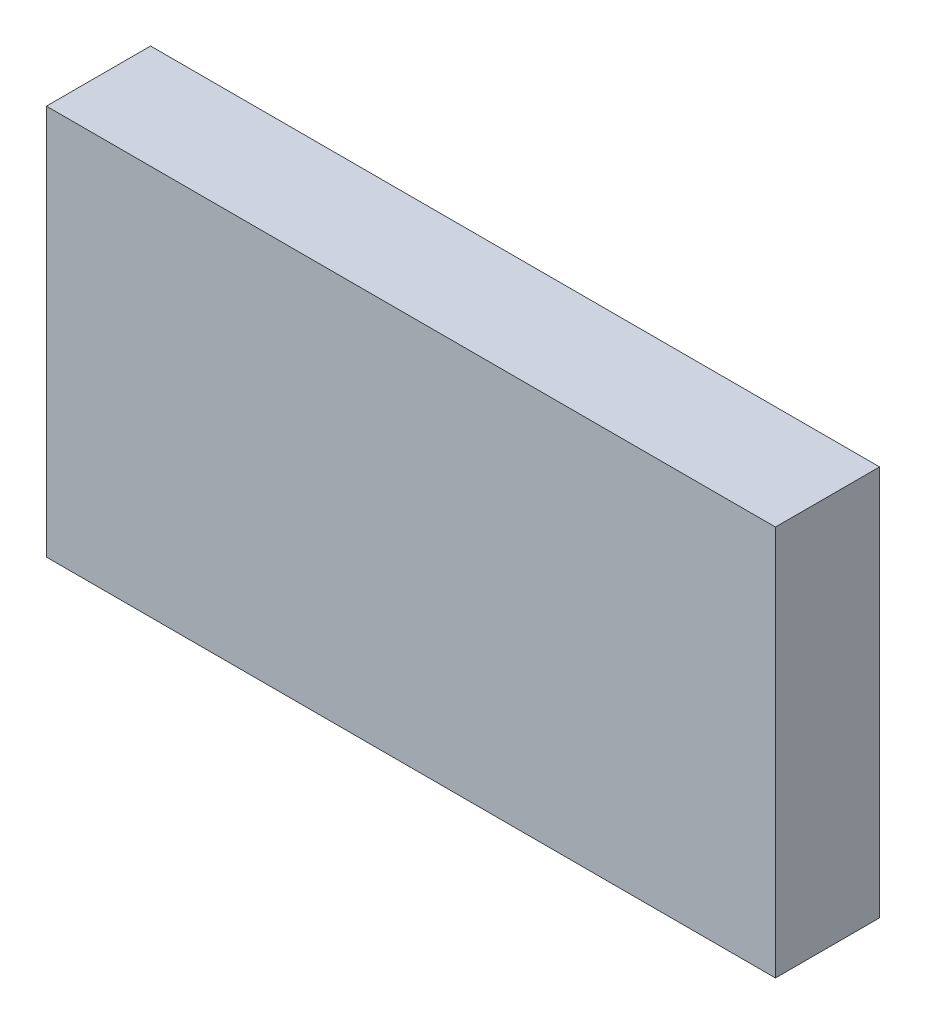
ISO-10303-21;
HEADER;
FILE_DESCRIPTION(('STEP AP214'),'2;1');
FILE_NAME('part.step','',(''),(''),'','','');
FILE_SCHEMA(('AUTOMOTIVE_DESIGN { 1 0 10303 214 1 1 1 1 }'));
ENDSEC;
DATA;
#1=APPLICATION_CONTEXT('core data for automotive mechanical design processes');
#2=APPLICATION_PROTOCOL_DEFINITION('international standard','automotive_design',2000,#1);
#3=PRODUCT_CONTEXT('',#1,'mechanical');
#4=PRODUCT('Part','Part','',(#3));
#5=PRODUCT_RELATED_PRODUCT_CATEGORY('part','',(#4));
#6=PRODUCT_DEFINITION_FORMATION('','',#4);
#7=PRODUCT_DEFINITION_CONTEXT('part definition',#1,'design');
#8=PRODUCT_DEFINITION('design','',#6,#7);
#9=PRODUCT_DEFINITION_SHAPE('','',#8);
#10=(LENGTH_UNIT() NAMED_UNIT(*) SI_UNIT(.MILLI.,.METRE.));
#11=(NAMED_UNIT(*) PLANE_ANGLE_UNIT() SI_UNIT($,.RADIAN.));
#12=(NAMED_UNIT(*) SI_UNIT($,.STERADIAN.) SOLID_ANGLE_UNIT());
#13=UNCERTAINTY_MEASURE_WITH_UNIT(LENGTH_MEASURE(1.E-05),#10,'distance_accuracy_value','');
#14=(GEOMETRIC_REPRESENTATION_CONTEXT(3) GLOBAL_UNCERTAINTY_ASSIGNED_CONTEXT((#13)) GLOBAL_UNIT_ASSIGNED_CONTEXT((#10,
#11,#12)) REPRESENTATION_CONTEXT('',''));
#15=CARTESIAN_POINT('',(0.,0.,0.));
#16=DIRECTION('',(0.,0.,1.));
#17=DIRECTION('',(1.,0.,0.));
#18=AXIS2_PLACEMENT_3D('',#15,#16,#17);
#19=CARTESIAN_POINT('',(0.104909158135323,-0.637922808555993,0.0826433070866142));
#20=DIRECTION('',(0.,0.,-1.));
#21=DIRECTION('',(0.,1.,0.));
#22=AXIS2_PLACEMENT_3D('',#19,#20,#21);
#23=PLANE('',#22);
#24=DIRECTION('',(0.,1.,0.));
#25=VECTOR('',#24,1.);
#26=CARTESIAN_POINT('',(0.108436717190441,-0.637922808555993,0.0826433070866142));
#27=LINE('',#26,#25);
#28=CARTESIAN_POINT('',(0.108436717190441,-0.598237769185914,0.0826433070866142));
#29=VERTEX_POINT('',#28);
#30=CARTESIAN_POINT('',(0.108436717190441,-0.636033044776465,0.0826433070866142));
#31=VERTEX_POINT('',#30);
#32=EDGE_CURVE('E71',#29,#31,#27,.F.);
#33=ORIENTED_EDGE('',*,*,#32,.T.);
#34=DIRECTION('',(1.,0.,0.));
#35=VECTOR('',#34,1.);
#36=CARTESIAN_POINT('',(0.182515457347921,-0.636033044776465,0.0826433070866142));
#37=LINE('',#36,#35);
#38=CARTESIAN_POINT('',(0.178987898292803,-0.636033044776465,0.0826433070866142));
#39=VERTEX_POINT('',#38);
#40=EDGE_CURVE('E54',#39,#31,#37,.F.);
#41=ORIENTED_EDGE('',*,*,#40,.F.);
#42=DIRECTION('',(0.,1.,0.));
#43=VECTOR('',#42,1.);
#44=CARTESIAN_POINT('',(0.178987898292803,-0.637922808555993,0.0826433070866142));
#45=LINE('',#44,#43);
#46=CARTESIAN_POINT('',(0.178987898292803,-0.598237769185914,0.0826433070866142));
#47=VERTEX_POINT('',#46);
#48=EDGE_CURVE('E20',#47,#39,#45,.F.);
#49=ORIENTED_EDGE('',*,*,#48,.F.);
#50=DIRECTION('',(1.,0.,0.));
#51=VECTOR('',#50,1.);
#52=CARTESIAN_POINT('',(0.182515457347921,-0.598237769185914,0.0826433070866142));
#53=LINE('',#52,#51);
#54=EDGE_CURVE('E81',#29,#47,#53,.T.);
#55=ORIENTED_EDGE('',*,*,#54,.F.);
#56=EDGE_LOOP('',(#33,#41,#49,#55));
#57=FACE_BOUND('',#56,.T.);
#58=ADVANCED_FACE('F17',(#57),#23,.F.);
#59=CARTESIAN_POINT('',(0.178987898292803,-0.637922808555993,0.0720606299212598));
#60=DIRECTION('',(-1.,0.,0.));
#61=DIRECTION('',(0.,0.,1.));
#62=AXIS2_PLACEMENT_3D('',#59,#60,#61);
#63=PLANE('',#62);
#64=DIRECTION('',(0.,0.,-1.));
#65=VECTOR('',#64,1.);
#66=CARTESIAN_POINT('',(0.178987898292803,-0.598237769185914,0.0831472440944882));
#67=LINE('',#66,#65);
#68=CARTESIAN_POINT('',(0.178987898292803,-0.598237769185914,0.0725645669291339));
#69=VERTEX_POINT('',#68);
#70=EDGE_CURVE('E64',#47,#69,#67,.T.);
#71=ORIENTED_EDGE('',*,*,#70,.F.);
#72=ORIENTED_EDGE('',*,*,#48,.T.);
#73=DIRECTION('',(0.,0.,1.));
#74=VECTOR('',#73,1.);
#75=CARTESIAN_POINT('',(0.178987898292803,-0.636033044776465,0.0720606299212598));
#76=LINE('',#75,#74);
#77=CARTESIAN_POINT('',(0.178987898292803,-0.636033044776465,0.0725645669291339));
#78=VERTEX_POINT('',#77);
#79=EDGE_CURVE('E62',#78,#39,#76,.T.);
#80=ORIENTED_EDGE('',*,*,#79,.F.);
#81=DIRECTION('',(0.,-1.,0.));
#82=VECTOR('',#81,1.);
#83=CARTESIAN_POINT('',(0.178987898292803,-0.637922808555993,0.0725645669291339));
#84=LINE('',#83,#82);
#85=EDGE_CURVE('E83',#69,#78,#84,.T.);
#86=ORIENTED_EDGE('',*,*,#85,.F.);
#87=EDGE_LOOP('',(#71,#72,#80,#86));
#88=FACE_BOUND('',#87,.T.);
#89=ADVANCED_FACE('F60',(#88),#63,.F.);
#90=CARTESIAN_POINT('',(0.182515457347921,-0.636033044776465,0.0720606299212598));
#91=DIRECTION('',(0.,1.,0.));
#92=DIRECTION('',(0.,0.,1.));
#93=AXIS2_PLACEMENT_3D('',#90,#91,#92);
#94=PLANE('',#93);
#95=DIRECTION('',(0.,0.,1.));
#96=VECTOR('',#95,1.);
#97=CARTESIAN_POINT('',(0.108436717190441,-0.636033044776465,0.0720606299212598));
#98=LINE('',#97,#96);
#99=CARTESIAN_POINT('',(0.108436717190441,-0.636033044776465,0.0725645669291339));
#100=VERTEX_POINT('',#99);
#101=EDGE_CURVE('E73',#31,#100,#98,.F.);
#102=ORIENTED_EDGE('',*,*,#101,.T.);
#103=DIRECTION('',(1.,0.,0.));
#104=VECTOR('',#103,1.);
#105=CARTESIAN_POINT('',(0.182515457347921,-0.636033044776465,0.0725645669291339));
#106=LINE('',#105,#104);
#107=EDGE_CURVE('E69',#78,#100,#106,.F.);
#108=ORIENTED_EDGE('',*,*,#107,.F.);
#109=ORIENTED_EDGE('',*,*,#79,.T.);
#110=ORIENTED_EDGE('',*,*,#40,.T.);
#111=EDGE_LOOP('',(#102,#108,#109,#110));
#112=FACE_BOUND('',#111,.T.);
#113=ADVANCED_FACE('F68',(#112),#94,.F.);
#114=CARTESIAN_POINT('',(0.108436717190441,-0.637922808555993,0.0720606299212598));
#115=DIRECTION('',(-1.,0.,0.));
#116=DIRECTION('',(0.,0.,1.));
#117=AXIS2_PLACEMENT_3D('',#114,#115,#116);
#118=PLANE('',#117);
#119=ORIENTED_EDGE('',*,*,#32,.F.);
#120=DIRECTION('',(0.,0.,-1.));
#121=VECTOR('',#120,1.);
#122=CARTESIAN_POINT('',(0.108436717190441,-0.598237769185914,0.0831472440944882));
#123=LINE('',#122,#121);
#124=CARTESIAN_POINT('',(0.108436717190441,-0.598237769185914,0.0725645669291339));
#125=VERTEX_POINT('',#124);
#126=EDGE_CURVE('E78',#125,#29,#123,.F.);
#127=ORIENTED_EDGE('',*,*,#126,.F.);
#128=DIRECTION('',(0.,-1.,0.));
#129=VECTOR('',#128,1.);
#130=CARTESIAN_POINT('',(0.108436717190441,-0.637922808555993,0.0725645669291339));
#131=LINE('',#130,#129);
#132=EDGE_CURVE('E26',#100,#125,#131,.F.);
#133=ORIENTED_EDGE('',*,*,#132,.F.);
#134=ORIENTED_EDGE('',*,*,#101,.F.);
#135=EDGE_LOOP('',(#119,#127,#133,#134));
#136=FACE_BOUND('',#135,.T.);
#137=ADVANCED_FACE('F88',(#136),#118,.T.);
#138=CARTESIAN_POINT('',(0.182515457347921,-0.598237769185914,0.0831472440944882));
#139=DIRECTION('',(0.,-1.,0.));
#140=DIRECTION('',(0.,0.,-1.));
#141=AXIS2_PLACEMENT_3D('',#138,#139,#140);
#142=PLANE('',#141);
#143=ORIENTED_EDGE('',*,*,#126,.T.);
#144=ORIENTED_EDGE('',*,*,#54,.T.);
#145=ORIENTED_EDGE('',*,*,#70,.T.);
#146=DIRECTION('',(1.,0.,0.));
#147=VECTOR('',#146,1.);
#148=CARTESIAN_POINT('',(0.182515457347921,-0.598237769185914,0.0725645669291339));
#149=LINE('',#148,#147);
#150=EDGE_CURVE('E11',#125,#69,#149,.T.);
#151=ORIENTED_EDGE('',*,*,#150,.F.);
#152=EDGE_LOOP('',(#143,#144,#145,#151));
#153=FACE_BOUND('',#152,.T.);
#154=ADVANCED_FACE('F91',(#153),#142,.F.);
#155=CARTESIAN_POINT('',(0.182515457347921,-0.637922808555993,0.0725645669291339));
#156=DIRECTION('',(0.,0.,1.));
#157=DIRECTION('',(0.,-1.,0.));
#158=AXIS2_PLACEMENT_3D('',#155,#156,#157);
#159=PLANE('',#158);
#160=ORIENTED_EDGE('',*,*,#132,.T.);
#161=ORIENTED_EDGE('',*,*,#150,.T.);
#162=ORIENTED_EDGE('',*,*,#85,.T.);
#163=ORIENTED_EDGE('',*,*,#107,.T.);
#164=EDGE_LOOP('',(#160,#161,#162,#163));
#165=FACE_BOUND('',#164,.T.);
#166=ADVANCED_FACE('F86',(#165),#159,.F.);
#167=CLOSED_SHELL('',(#58,#89,#113,#137,#154,#166));
#168=MANIFOLD_SOLID_BREP('B1',#167);
#169=ADVANCED_BREP_SHAPE_REPRESENTATION('',(#18,#168),#14);
#170=SHAPE_DEFINITION_REPRESENTATION(#9,#169);
ENDSEC;
END-ISO-10303-21;
